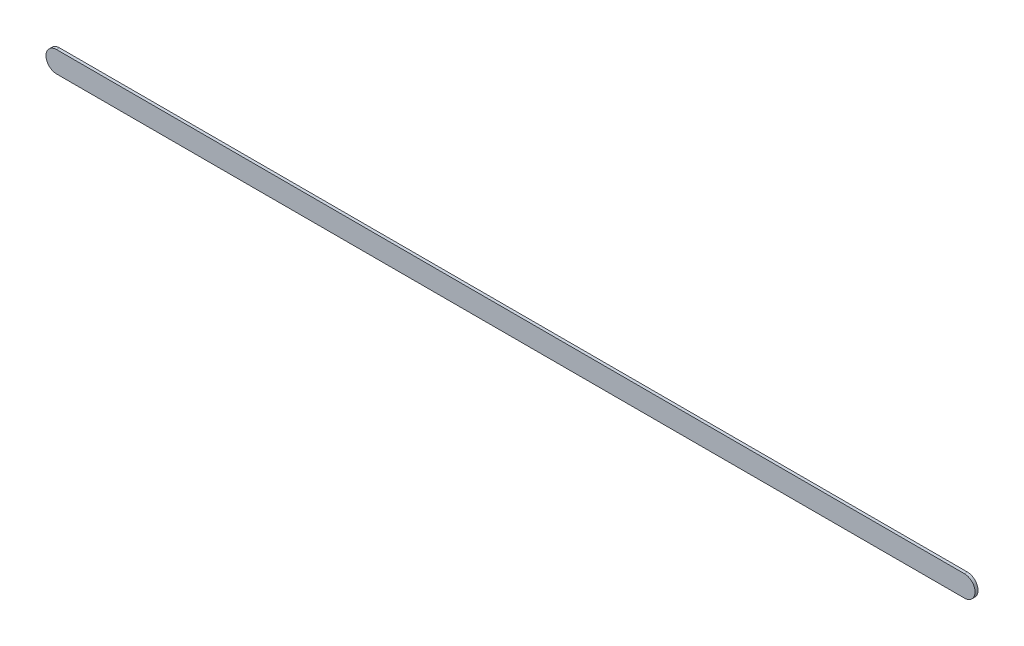
ISO-10303-21;
HEADER;
FILE_DESCRIPTION(('STEP AP214'),'2;1');
FILE_NAME('part.step','',(''),(''),'','','');
FILE_SCHEMA(('AUTOMOTIVE_DESIGN { 1 0 10303 214 1 1 1 1 }'));
ENDSEC;
DATA;
#1=APPLICATION_CONTEXT('core data for automotive mechanical design processes');
#2=APPLICATION_PROTOCOL_DEFINITION('international standard','automotive_design',2000,#1);
#3=PRODUCT_CONTEXT('',#1,'mechanical');
#4=PRODUCT('Part','Part','',(#3));
#5=PRODUCT_RELATED_PRODUCT_CATEGORY('part','',(#4));
#6=PRODUCT_DEFINITION_FORMATION('','',#4);
#7=PRODUCT_DEFINITION_CONTEXT('part definition',#1,'design');
#8=PRODUCT_DEFINITION('design','',#6,#7);
#9=PRODUCT_DEFINITION_SHAPE('','',#8);
#10=(LENGTH_UNIT() NAMED_UNIT(*) SI_UNIT(.MILLI.,.METRE.));
#11=(NAMED_UNIT(*) PLANE_ANGLE_UNIT() SI_UNIT($,.RADIAN.));
#12=(NAMED_UNIT(*) SI_UNIT($,.STERADIAN.) SOLID_ANGLE_UNIT());
#13=UNCERTAINTY_MEASURE_WITH_UNIT(LENGTH_MEASURE(1.E-05),#10,'distance_accuracy_value','');
#14=(GEOMETRIC_REPRESENTATION_CONTEXT(3) GLOBAL_UNCERTAINTY_ASSIGNED_CONTEXT((#13)) GLOBAL_UNIT_ASSIGNED_CONTEXT((#10,
#11,#12)) REPRESENTATION_CONTEXT('',''));
#15=CARTESIAN_POINT('',(0.,0.,0.));
#16=DIRECTION('',(0.,0.,1.));
#17=DIRECTION('',(1.,0.,0.));
#18=AXIS2_PLACEMENT_3D('',#15,#16,#17);
#19=CARTESIAN_POINT('',(83.83756156,105.25997236,0.));
#20=DIRECTION('',(0.,1.,0.));
#21=DIRECTION('',(1.,0.,0.));
#22=AXIS2_PLACEMENT_3D('',#19,#20,#21);
#23=PLANE('',#22);
#24=DIRECTION('',(1.,0.,0.));
#25=VECTOR('',#24,1.);
#26=CARTESIAN_POINT('',(83.83756156,105.25997236,0.03556));
#27=LINE('',#26,#25);
#28=CARTESIAN_POINT('',(83.83756156,105.25997236,0.03556));
#29=VERTEX_POINT('',#28);
#30=CARTESIAN_POINT('',(94.73312524,105.25997236,0.03556));
#31=VERTEX_POINT('',#30);
#32=EDGE_CURVE('E11',#29,#31,#27,.T.);
#33=ORIENTED_EDGE('',*,*,#32,.F.);
#34=DIRECTION('',(0.,0.,1.));
#35=VECTOR('',#34,1.);
#36=CARTESIAN_POINT('',(83.83756156,105.25997236,0.));
#37=LINE('',#36,#35);
#38=CARTESIAN_POINT('',(83.83756156,105.25997236,0.));
#39=VERTEX_POINT('',#38);
#40=EDGE_CURVE('E24',#39,#29,#37,.T.);
#41=ORIENTED_EDGE('',*,*,#40,.F.);
#42=DIRECTION('',(1.,0.,0.));
#43=VECTOR('',#42,1.);
#44=CARTESIAN_POINT('',(83.83756156,105.25997236,0.));
#45=LINE('',#44,#43);
#46=CARTESIAN_POINT('',(94.73312524,105.25997236,0.));
#47=VERTEX_POINT('',#46);
#48=EDGE_CURVE('E75',#39,#47,#45,.T.);
#49=ORIENTED_EDGE('',*,*,#48,.T.);
#50=DIRECTION('',(0.,0.,1.));
#51=VECTOR('',#50,1.);
#52=CARTESIAN_POINT('',(94.73312524,105.25997236,0.));
#53=LINE('',#52,#51);
#54=EDGE_CURVE('E37',#47,#31,#53,.T.);
#55=ORIENTED_EDGE('',*,*,#54,.T.);
#56=EDGE_LOOP('',(#33,#41,#49,#55));
#57=FACE_BOUND('',#56,.T.);
#58=ADVANCED_FACE('F17',(#57),#23,.F.);
#59=CARTESIAN_POINT('',(94.73312524,105.38697236,0.));
#60=DIRECTION('',(0.,0.,-1.));
#61=DIRECTION('',(1.11896493820492E-13,-1.,0.));
#62=AXIS2_PLACEMENT_3D('',#59,#60,#61);
#63=CYLINDRICAL_SURFACE('',#62,0.127000000000005);
#64=CARTESIAN_POINT('',(94.73312524,105.38697236,0.03556));
#65=DIRECTION('',(0.,0.,1.));
#66=DIRECTION('',(1.11896493820492E-13,-1.,0.));
#67=AXIS2_PLACEMENT_3D('',#64,#65,#66);
#68=CIRCLE('',#67,0.127000000000005);
#69=CARTESIAN_POINT('',(94.73312524,105.51397236,0.03556));
#70=VERTEX_POINT('',#69);
#71=EDGE_CURVE('E83',#31,#70,#68,.T.);
#72=ORIENTED_EDGE('',*,*,#71,.F.);
#73=ORIENTED_EDGE('',*,*,#54,.F.);
#74=CARTESIAN_POINT('',(94.73312524,105.38697236,0.));
#75=DIRECTION('',(0.,0.,1.));
#76=DIRECTION('',(1.11896493820492E-13,-1.,0.));
#77=AXIS2_PLACEMENT_3D('',#74,#75,#76);
#78=CIRCLE('',#77,0.127000000000005);
#79=CARTESIAN_POINT('',(94.73312524,105.51397236,0.));
#80=VERTEX_POINT('',#79);
#81=EDGE_CURVE('E81',#47,#80,#78,.T.);
#82=ORIENTED_EDGE('',*,*,#81,.T.);
#83=DIRECTION('',(0.,0.,1.));
#84=VECTOR('',#83,1.);
#85=CARTESIAN_POINT('',(94.73312524,105.51397236,0.));
#86=LINE('',#85,#84);
#87=EDGE_CURVE('E67',#80,#70,#86,.T.);
#88=ORIENTED_EDGE('',*,*,#87,.T.);
#89=EDGE_LOOP('',(#72,#73,#82,#88));
#90=FACE_BOUND('',#89,.T.);
#91=ADVANCED_FACE('F89',(#90),#63,.T.);
#92=CARTESIAN_POINT('',(94.73312524,105.51397236,0.));
#93=DIRECTION('',(0.,-1.,0.));
#94=DIRECTION('',(-1.,0.,0.));
#95=AXIS2_PLACEMENT_3D('',#92,#93,#94);
#96=PLANE('',#95);
#97=DIRECTION('',(-1.,0.,0.));
#98=VECTOR('',#97,1.);
#99=CARTESIAN_POINT('',(94.73312524,105.51397236,0.03556));
#100=LINE('',#99,#98);
#101=CARTESIAN_POINT('',(83.83756156,105.51397236,0.03556));
#102=VERTEX_POINT('',#101);
#103=EDGE_CURVE('E71',#70,#102,#100,.T.);
#104=ORIENTED_EDGE('',*,*,#103,.F.);
#105=ORIENTED_EDGE('',*,*,#87,.F.);
#106=DIRECTION('',(-1.,0.,0.));
#107=VECTOR('',#106,1.);
#108=CARTESIAN_POINT('',(94.73312524,105.51397236,0.));
#109=LINE('',#108,#107);
#110=CARTESIAN_POINT('',(83.83756156,105.51397236,0.));
#111=VERTEX_POINT('',#110);
#112=EDGE_CURVE('E63',#80,#111,#109,.T.);
#113=ORIENTED_EDGE('',*,*,#112,.T.);
#114=DIRECTION('',(0.,0.,1.));
#115=VECTOR('',#114,1.);
#116=CARTESIAN_POINT('',(83.83756156,105.51397236,0.));
#117=LINE('',#116,#115);
#118=EDGE_CURVE('E53',#111,#102,#117,.T.);
#119=ORIENTED_EDGE('',*,*,#118,.T.);
#120=EDGE_LOOP('',(#104,#105,#113,#119));
#121=FACE_BOUND('',#120,.T.);
#122=ADVANCED_FACE('F66',(#121),#96,.F.);
#123=CARTESIAN_POINT('',(83.83756156,105.38697236,0.));
#124=DIRECTION('',(0.,0.,-1.));
#125=DIRECTION('',(-1.1189649382048E-13,1.,0.));
#126=AXIS2_PLACEMENT_3D('',#123,#124,#125);
#127=CYLINDRICAL_SURFACE('',#126,0.127000000000005);
#128=CARTESIAN_POINT('',(83.83756156,105.38697236,0.03556));
#129=DIRECTION('',(0.,0.,1.));
#130=DIRECTION('',(-1.1189649382048E-13,1.,0.));
#131=AXIS2_PLACEMENT_3D('',#128,#129,#130);
#132=CIRCLE('',#131,0.127000000000005);
#133=EDGE_CURVE('E59',#102,#29,#132,.T.);
#134=ORIENTED_EDGE('',*,*,#133,.F.);
#135=ORIENTED_EDGE('',*,*,#118,.F.);
#136=CARTESIAN_POINT('',(83.83756156,105.38697236,0.));
#137=DIRECTION('',(0.,0.,1.));
#138=DIRECTION('',(-1.1189649382048E-13,1.,0.));
#139=AXIS2_PLACEMENT_3D('',#136,#137,#138);
#140=CIRCLE('',#139,0.127000000000005);
#141=EDGE_CURVE('E57',#111,#39,#140,.T.);
#142=ORIENTED_EDGE('',*,*,#141,.T.);
#143=ORIENTED_EDGE('',*,*,#40,.T.);
#144=EDGE_LOOP('',(#134,#135,#142,#143));
#145=FACE_BOUND('',#144,.T.);
#146=ADVANCED_FACE('F55',(#145),#127,.T.);
#147=CARTESIAN_POINT('',(83.83756156,105.25997236,0.));
#148=DIRECTION('',(0.,0.,-1.));
#149=DIRECTION('',(-1.,0.,0.));
#150=AXIS2_PLACEMENT_3D('',#147,#148,#149);
#151=PLANE('',#150);
#152=ORIENTED_EDGE('',*,*,#141,.F.);
#153=ORIENTED_EDGE('',*,*,#112,.F.);
#154=ORIENTED_EDGE('',*,*,#81,.F.);
#155=ORIENTED_EDGE('',*,*,#48,.F.);
#156=EDGE_LOOP('',(#152,#153,#154,#155));
#157=FACE_BOUND('',#156,.T.);
#158=ADVANCED_FACE('F74',(#157),#151,.T.);
#159=CARTESIAN_POINT('',(83.83756156,105.25997236,0.03556));
#160=DIRECTION('',(0.,0.,-1.));
#161=DIRECTION('',(-1.,0.,0.));
#162=AXIS2_PLACEMENT_3D('',#159,#160,#161);
#163=PLANE('',#162);
#164=ORIENTED_EDGE('',*,*,#32,.T.);
#165=ORIENTED_EDGE('',*,*,#71,.T.);
#166=ORIENTED_EDGE('',*,*,#103,.T.);
#167=ORIENTED_EDGE('',*,*,#133,.T.);
#168=EDGE_LOOP('',(#164,#165,#166,#167));
#169=FACE_BOUND('',#168,.T.);
#170=ADVANCED_FACE('F91',(#169),#163,.F.);
#171=CLOSED_SHELL('',(#58,#91,#122,#146,#158,#170));
#172=MANIFOLD_SOLID_BREP('B1',#171);
#173=ADVANCED_BREP_SHAPE_REPRESENTATION('',(#18,#172),#14);
#174=SHAPE_DEFINITION_REPRESENTATION(#9,#173);
ENDSEC;
END-ISO-10303-21;
